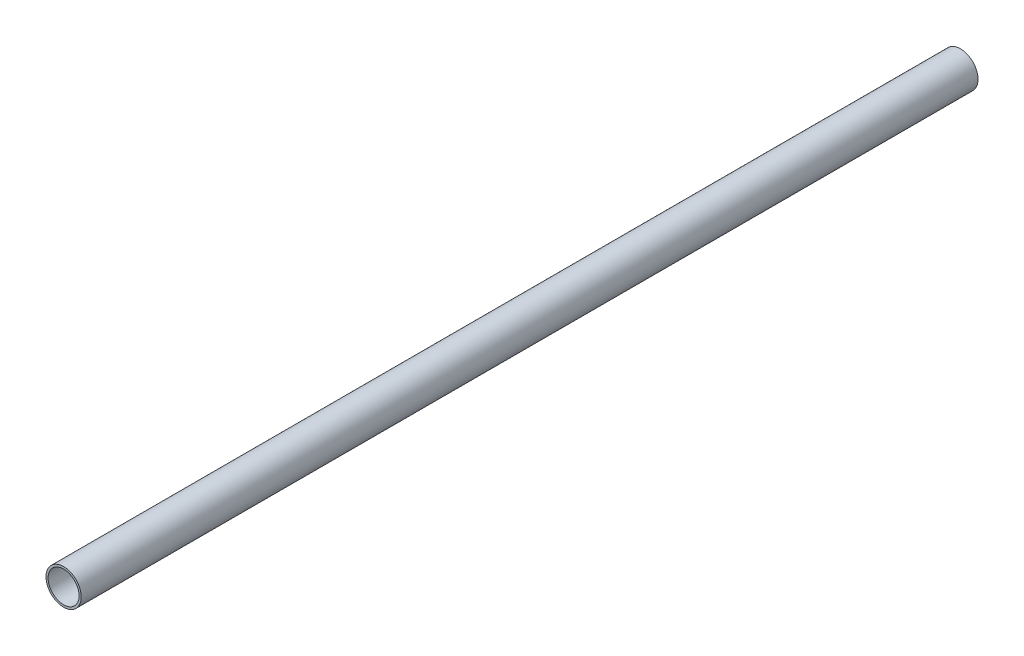
ISO-10303-21;
HEADER;
FILE_DESCRIPTION(('STEP AP214'),'2;1');
FILE_NAME('part.step','',(''),(''),'','','');
FILE_SCHEMA(('AUTOMOTIVE_DESIGN { 1 0 10303 214 1 1 1 1 }'));
ENDSEC;
DATA;
#1=APPLICATION_CONTEXT('core data for automotive mechanical design processes');
#2=APPLICATION_PROTOCOL_DEFINITION('international standard','automotive_design',2000,#1);
#3=PRODUCT_CONTEXT('',#1,'mechanical');
#4=PRODUCT('Part','Part','',(#3));
#5=PRODUCT_RELATED_PRODUCT_CATEGORY('part','',(#4));
#6=PRODUCT_DEFINITION_FORMATION('','',#4);
#7=PRODUCT_DEFINITION_CONTEXT('part definition',#1,'design');
#8=PRODUCT_DEFINITION('design','',#6,#7);
#9=PRODUCT_DEFINITION_SHAPE('','',#8);
#10=(LENGTH_UNIT() NAMED_UNIT(*) SI_UNIT(.MILLI.,.METRE.));
#11=(NAMED_UNIT(*) PLANE_ANGLE_UNIT() SI_UNIT($,.RADIAN.));
#12=(NAMED_UNIT(*) SI_UNIT($,.STERADIAN.) SOLID_ANGLE_UNIT());
#13=UNCERTAINTY_MEASURE_WITH_UNIT(LENGTH_MEASURE(1.E-05),#10,'distance_accuracy_value','');
#14=(GEOMETRIC_REPRESENTATION_CONTEXT(3) GLOBAL_UNCERTAINTY_ASSIGNED_CONTEXT((#13)) GLOBAL_UNIT_ASSIGNED_CONTEXT((#10,
#11,#12)) REPRESENTATION_CONTEXT('',''));
#15=CARTESIAN_POINT('',(0.,0.,0.));
#16=DIRECTION('',(0.,0.,1.));
#17=DIRECTION('',(1.,0.,0.));
#18=AXIS2_PLACEMENT_3D('',#15,#16,#17);
#19=CARTESIAN_POINT('',(0.,1269.,-2383.));
#20=DIRECTION('',(0.,0.,-1.));
#21=DIRECTION('',(-1.,0.,0.));
#22=AXIS2_PLACEMENT_3D('',#19,#20,#21);
#23=CYLINDRICAL_SURFACE('',#22,12.5);
#24=CARTESIAN_POINT('',(0.,1269.,-3040.));
#25=DIRECTION('',(0.,0.,-1.));
#26=DIRECTION('',(-1.,0.,0.));
#27=AXIS2_PLACEMENT_3D('',#24,#25,#26);
#28=CIRCLE('',#27,12.5);
#29=CARTESIAN_POINT('',(-12.5,1269.,-3040.));
#30=VERTEX_POINT('',#29);
#31=EDGE_CURVE('E58',#30,#30,#28,.T.);
#32=ORIENTED_EDGE('',*,*,#31,.F.);
#33=EDGE_LOOP('',(#32));
#34=FACE_BOUND('',#33,.T.);
#35=CARTESIAN_POINT('',(0.,1269.,-2403.));
#36=DIRECTION('',(0.,0.,1.));
#37=DIRECTION('',(0.,-1.,0.));
#38=AXIS2_PLACEMENT_3D('',#35,#36,#37);
#39=CIRCLE('',#38,12.5);
#40=CARTESIAN_POINT('',(0.,1256.5,-2403.));
#41=VERTEX_POINT('',#40);
#42=EDGE_CURVE('E45',#41,#41,#39,.T.);
#43=ORIENTED_EDGE('',*,*,#42,.F.);
#44=EDGE_LOOP('',(#43));
#45=FACE_BOUND('',#44,.T.);
#46=ADVANCED_FACE('F41',(#34,#45),#23,.T.);
#47=CARTESIAN_POINT('',(-15.4999999999998,-2.22044604925031E-13,-3040.));
#48=DIRECTION('',(0.,0.,-1.));
#49=DIRECTION('',(-1.,0.,0.));
#50=AXIS2_PLACEMENT_3D('',#47,#48,#49);
#51=PLANE('',#50);
#52=CARTESIAN_POINT('',(0.,1269.,-3040.));
#53=DIRECTION('',(0.,0.,-1.));
#54=DIRECTION('',(-1.,0.,0.));
#55=AXIS2_PLACEMENT_3D('',#52,#53,#54);
#56=CIRCLE('',#55,10.9999999999999);
#57=CARTESIAN_POINT('',(-10.9999999999999,1269.,-3040.));
#58=VERTEX_POINT('',#57);
#59=EDGE_CURVE('E56',#58,#58,#56,.T.);
#60=ORIENTED_EDGE('',*,*,#59,.F.);
#61=EDGE_LOOP('',(#60));
#62=FACE_BOUND('',#61,.T.);
#63=ORIENTED_EDGE('',*,*,#31,.T.);
#64=EDGE_LOOP('',(#63));
#65=FACE_BOUND('',#64,.T.);
#66=ADVANCED_FACE('F72',(#62,#65),#51,.T.);
#67=CARTESIAN_POINT('',(-15.4999999999998,1.33226762955019E-12,-2403.));
#68=DIRECTION('',(0.,0.,1.));
#69=DIRECTION('',(0.,-1.,0.));
#70=AXIS2_PLACEMENT_3D('',#67,#68,#69);
#71=PLANE('',#70);
#72=CARTESIAN_POINT('',(0.,1269.,-2403.));
#73=DIRECTION('',(0.,0.,1.));
#74=DIRECTION('',(0.,-1.,0.));
#75=AXIS2_PLACEMENT_3D('',#72,#73,#74);
#76=CIRCLE('',#75,10.9999999999999);
#77=CARTESIAN_POINT('',(0.,1258.,-2403.));
#78=VERTEX_POINT('',#77);
#79=EDGE_CURVE('E10',#78,#78,#76,.T.);
#80=ORIENTED_EDGE('',*,*,#79,.F.);
#81=EDGE_LOOP('',(#80));
#82=FACE_BOUND('',#81,.T.);
#83=ORIENTED_EDGE('',*,*,#42,.T.);
#84=EDGE_LOOP('',(#83));
#85=FACE_BOUND('',#84,.T.);
#86=ADVANCED_FACE('F74',(#82,#85),#71,.T.);
#87=CARTESIAN_POINT('',(0.,1269.,-2383.));
#88=DIRECTION('',(0.,0.,-1.));
#89=DIRECTION('',(-1.,0.,0.));
#90=AXIS2_PLACEMENT_3D('',#87,#88,#89);
#91=CYLINDRICAL_SURFACE('',#90,10.9999999999999);
#92=ORIENTED_EDGE('',*,*,#59,.T.);
#93=EDGE_LOOP('',(#92));
#94=FACE_BOUND('',#93,.T.);
#95=ORIENTED_EDGE('',*,*,#79,.T.);
#96=EDGE_LOOP('',(#95));
#97=FACE_BOUND('',#96,.T.);
#98=ADVANCED_FACE('F43',(#94,#97),#91,.F.);
#99=CLOSED_SHELL('',(#46,#66,#86,#98));
#100=MANIFOLD_SOLID_BREP('B2',#99);
#101=ADVANCED_BREP_SHAPE_REPRESENTATION('',(#18,#100),#14);
#102=SHAPE_DEFINITION_REPRESENTATION(#9,#101);
ENDSEC;
END-ISO-10303-21;
